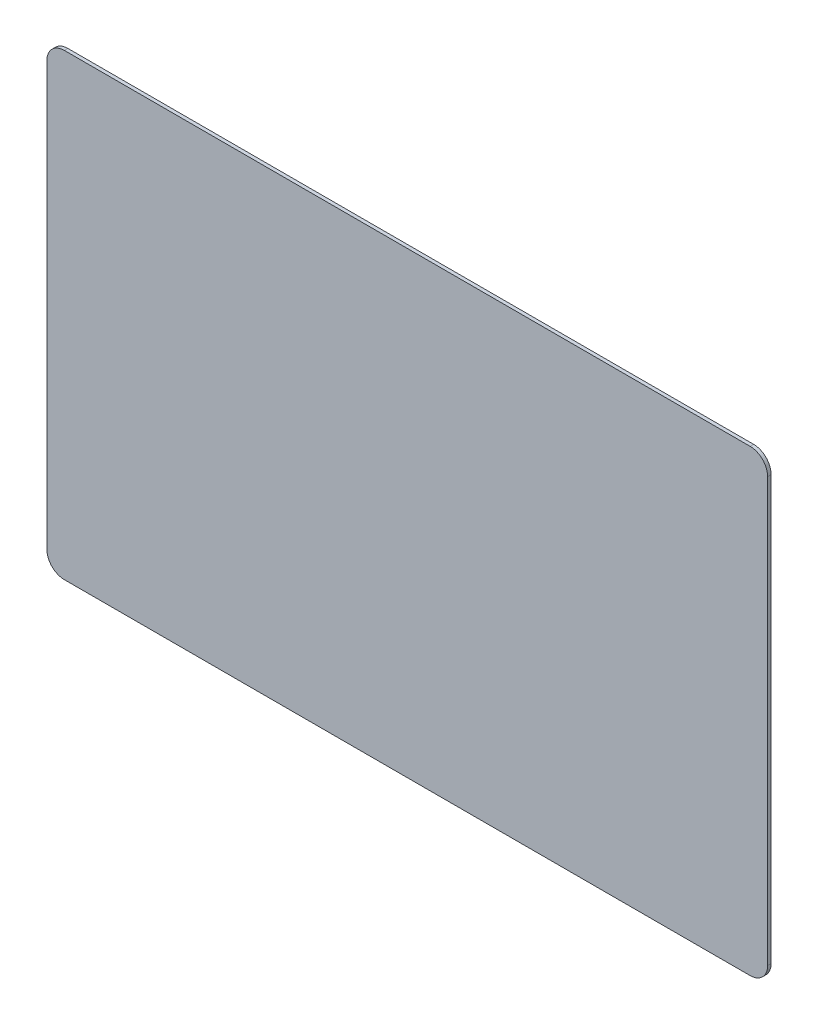
ISO-10303-21;
HEADER;
FILE_DESCRIPTION(('STEP AP214'),'2;1');
FILE_NAME('part.step','',(''),(''),'','','');
FILE_SCHEMA(('AUTOMOTIVE_DESIGN { 1 0 10303 214 1 1 1 1 }'));
ENDSEC;
DATA;
#1=APPLICATION_CONTEXT('core data for automotive mechanical design processes');
#2=APPLICATION_PROTOCOL_DEFINITION('international standard','automotive_design',2000,#1);
#3=PRODUCT_CONTEXT('',#1,'mechanical');
#4=PRODUCT('Part','Part','',(#3));
#5=PRODUCT_RELATED_PRODUCT_CATEGORY('part','',(#4));
#6=PRODUCT_DEFINITION_FORMATION('','',#4);
#7=PRODUCT_DEFINITION_CONTEXT('part definition',#1,'design');
#8=PRODUCT_DEFINITION('design','',#6,#7);
#9=PRODUCT_DEFINITION_SHAPE('','',#8);
#10=(LENGTH_UNIT() NAMED_UNIT(*) SI_UNIT(.MILLI.,.METRE.));
#11=(NAMED_UNIT(*) PLANE_ANGLE_UNIT() SI_UNIT($,.RADIAN.));
#12=(NAMED_UNIT(*) SI_UNIT($,.STERADIAN.) SOLID_ANGLE_UNIT());
#13=UNCERTAINTY_MEASURE_WITH_UNIT(LENGTH_MEASURE(1.E-05),#10,'distance_accuracy_value','');
#14=(GEOMETRIC_REPRESENTATION_CONTEXT(3) GLOBAL_UNCERTAINTY_ASSIGNED_CONTEXT((#13)) GLOBAL_UNIT_ASSIGNED_CONTEXT((#10,
#11,#12)) REPRESENTATION_CONTEXT('',''));
#15=CARTESIAN_POINT('',(0.,0.,0.));
#16=DIRECTION('',(0.,0.,1.));
#17=DIRECTION('',(1.,0.,0.));
#18=AXIS2_PLACEMENT_3D('',#15,#16,#17);
#19=CARTESIAN_POINT('',(-124.502923218294,-124.541494532199,2.));
#20=DIRECTION('',(0.,0.,-1.));
#21=DIRECTION('',(-1.,0.,0.));
#22=AXIS2_PLACEMENT_3D('',#19,#20,#21);
#23=CYLINDRICAL_SURFACE('',#22,9.99999999999999);
#24=CARTESIAN_POINT('',(-124.502923218294,-124.541494532199,0.));
#25=DIRECTION('',(0.,0.,-1.));
#26=DIRECTION('',(-1.,0.,0.));
#27=AXIS2_PLACEMENT_3D('',#24,#25,#26);
#28=CIRCLE('',#27,9.99999999999999);
#29=CARTESIAN_POINT('',(-124.502923218294,-134.541494532199,0.));
#30=VERTEX_POINT('',#29);
#31=CARTESIAN_POINT('',(-134.502923218294,-124.541494532199,0.));
#32=VERTEX_POINT('',#31);
#33=EDGE_CURVE('E138',#30,#32,#28,.T.);
#34=ORIENTED_EDGE('',*,*,#33,.F.);
#35=DIRECTION('',(0.,0.,-1.));
#36=VECTOR('',#35,1.);
#37=CARTESIAN_POINT('',(-124.502923218294,-134.541494532199,2.));
#38=LINE('',#37,#36);
#39=CARTESIAN_POINT('',(-124.502923218294,-134.541494532199,2.));
#40=VERTEX_POINT('',#39);
#41=EDGE_CURVE('E11',#40,#30,#38,.T.);
#42=ORIENTED_EDGE('',*,*,#41,.F.);
#43=CARTESIAN_POINT('',(-124.502923218294,-124.541494532199,2.));
#44=DIRECTION('',(0.,0.,-1.));
#45=DIRECTION('',(-1.,0.,0.));
#46=AXIS2_PLACEMENT_3D('',#43,#44,#45);
#47=CIRCLE('',#46,9.99999999999999);
#48=CARTESIAN_POINT('',(-134.502923218294,-124.541494532199,2.));
#49=VERTEX_POINT('',#48);
#50=EDGE_CURVE('E156',#40,#49,#47,.T.);
#51=ORIENTED_EDGE('',*,*,#50,.T.);
#52=DIRECTION('',(0.,0.,-1.));
#53=VECTOR('',#52,1.);
#54=CARTESIAN_POINT('',(-134.502923218294,-124.541494532199,2.));
#55=LINE('',#54,#53);
#56=EDGE_CURVE('E43',#49,#32,#55,.T.);
#57=ORIENTED_EDGE('',*,*,#56,.T.);
#58=EDGE_LOOP('',(#34,#42,#51,#57));
#59=FACE_BOUND('',#58,.T.);
#60=ADVANCED_FACE('F40',(#59),#23,.T.);
#61=CARTESIAN_POINT('',(-124.502923218294,-134.541494532199,2.));
#62=DIRECTION('',(0.,1.,0.));
#63=DIRECTION('',(0.,0.,1.));
#64=AXIS2_PLACEMENT_3D('',#61,#62,#63);
#65=PLANE('',#64);
#66=DIRECTION('',(1.,0.,0.));
#67=VECTOR('',#66,1.);
#68=CARTESIAN_POINT('',(-124.502923218294,-134.541494532199,0.));
#69=LINE('',#68,#67);
#70=CARTESIAN_POINT('',(267.497076781706,-134.541494532199,0.));
#71=VERTEX_POINT('',#70);
#72=EDGE_CURVE('E85',#30,#71,#69,.T.);
#73=ORIENTED_EDGE('',*,*,#72,.T.);
#74=DIRECTION('',(0.,0.,-1.));
#75=VECTOR('',#74,1.);
#76=CARTESIAN_POINT('',(267.497076781706,-134.541494532199,2.));
#77=LINE('',#76,#75);
#78=CARTESIAN_POINT('',(267.497076781706,-134.541494532199,2.));
#79=VERTEX_POINT('',#78);
#80=EDGE_CURVE('E49',#79,#71,#77,.T.);
#81=ORIENTED_EDGE('',*,*,#80,.F.);
#82=DIRECTION('',(1.,0.,0.));
#83=VECTOR('',#82,1.);
#84=CARTESIAN_POINT('',(-124.502923218294,-134.541494532199,2.));
#85=LINE('',#84,#83);
#86=EDGE_CURVE('E116',#40,#79,#85,.T.);
#87=ORIENTED_EDGE('',*,*,#86,.F.);
#88=ORIENTED_EDGE('',*,*,#41,.T.);
#89=EDGE_LOOP('',(#73,#81,#87,#88));
#90=FACE_BOUND('',#89,.T.);
#91=ADVANCED_FACE('F195',(#90),#65,.F.);
#92=CARTESIAN_POINT('',(267.497076781706,-124.541494532199,2.));
#93=DIRECTION('',(0.,0.,-1.));
#94=DIRECTION('',(-1.,0.,0.));
#95=AXIS2_PLACEMENT_3D('',#92,#93,#94);
#96=CYLINDRICAL_SURFACE('',#95,10.);
#97=CARTESIAN_POINT('',(267.497076781706,-124.541494532199,0.));
#98=DIRECTION('',(0.,0.,1.));
#99=DIRECTION('',(1.,0.,0.));
#100=AXIS2_PLACEMENT_3D('',#97,#98,#99);
#101=CIRCLE('',#100,10.);
#102=CARTESIAN_POINT('',(277.497076781706,-124.541494532199,0.));
#103=VERTEX_POINT('',#102);
#104=EDGE_CURVE('E123',#71,#103,#101,.T.);
#105=ORIENTED_EDGE('',*,*,#104,.T.);
#106=DIRECTION('',(0.,0.,-1.));
#107=VECTOR('',#106,1.);
#108=CARTESIAN_POINT('',(277.497076781706,-124.541494532199,2.));
#109=LINE('',#108,#107);
#110=CARTESIAN_POINT('',(277.497076781706,-124.541494532199,2.));
#111=VERTEX_POINT('',#110);
#112=EDGE_CURVE('E120',#111,#103,#109,.T.);
#113=ORIENTED_EDGE('',*,*,#112,.F.);
#114=CARTESIAN_POINT('',(267.497076781706,-124.541494532199,2.));
#115=DIRECTION('',(0.,0.,1.));
#116=DIRECTION('',(1.,0.,0.));
#117=AXIS2_PLACEMENT_3D('',#114,#115,#116);
#118=CIRCLE('',#117,10.);
#119=EDGE_CURVE('E111',#79,#111,#118,.T.);
#120=ORIENTED_EDGE('',*,*,#119,.F.);
#121=ORIENTED_EDGE('',*,*,#80,.T.);
#122=EDGE_LOOP('',(#105,#113,#120,#121));
#123=FACE_BOUND('',#122,.T.);
#124=ADVANCED_FACE('F121',(#123),#96,.T.);
#125=CARTESIAN_POINT('',(277.497076781706,117.458505467801,2.));
#126=DIRECTION('',(1.,0.,0.));
#127=DIRECTION('',(0.,0.,-1.));
#128=AXIS2_PLACEMENT_3D('',#125,#126,#127);
#129=PLANE('',#128);
#130=DIRECTION('',(0.,-1.,0.));
#131=VECTOR('',#130,1.);
#132=CARTESIAN_POINT('',(277.497076781706,117.458505467801,0.));
#133=LINE('',#132,#131);
#134=CARTESIAN_POINT('',(277.497076781706,117.458505467801,0.));
#135=VERTEX_POINT('',#134);
#136=EDGE_CURVE('E153',#135,#103,#133,.T.);
#137=ORIENTED_EDGE('',*,*,#136,.F.);
#138=DIRECTION('',(0.,0.,-1.));
#139=VECTOR('',#138,1.);
#140=CARTESIAN_POINT('',(277.497076781706,117.458505467801,2.));
#141=LINE('',#140,#139);
#142=CARTESIAN_POINT('',(277.497076781706,117.458505467801,2.));
#143=VERTEX_POINT('',#142);
#144=EDGE_CURVE('E127',#143,#135,#141,.T.);
#145=ORIENTED_EDGE('',*,*,#144,.F.);
#146=DIRECTION('',(0.,-1.,0.));
#147=VECTOR('',#146,1.);
#148=CARTESIAN_POINT('',(277.497076781706,117.458505467801,2.));
#149=LINE('',#148,#147);
#150=EDGE_CURVE('E115',#143,#111,#149,.T.);
#151=ORIENTED_EDGE('',*,*,#150,.T.);
#152=ORIENTED_EDGE('',*,*,#112,.T.);
#153=EDGE_LOOP('',(#137,#145,#151,#152));
#154=FACE_BOUND('',#153,.T.);
#155=ADVANCED_FACE('F129',(#154),#129,.T.);
#156=CARTESIAN_POINT('',(267.497076781706,117.458505467801,2.));
#157=DIRECTION('',(0.,0.,-1.));
#158=DIRECTION('',(-1.,0.,0.));
#159=AXIS2_PLACEMENT_3D('',#156,#157,#158);
#160=CYLINDRICAL_SURFACE('',#159,10.);
#161=CARTESIAN_POINT('',(267.497076781706,117.458505467801,0.));
#162=DIRECTION('',(0.,0.,1.));
#163=DIRECTION('',(1.,0.,0.));
#164=AXIS2_PLACEMENT_3D('',#161,#162,#163);
#165=CIRCLE('',#164,10.);
#166=CARTESIAN_POINT('',(267.497076781706,127.458505467801,0.));
#167=VERTEX_POINT('',#166);
#168=EDGE_CURVE('E150',#135,#167,#165,.T.);
#169=ORIENTED_EDGE('',*,*,#168,.T.);
#170=DIRECTION('',(0.,0.,-1.));
#171=VECTOR('',#170,1.);
#172=CARTESIAN_POINT('',(267.497076781706,127.458505467801,2.));
#173=LINE('',#172,#171);
#174=CARTESIAN_POINT('',(267.497076781706,127.458505467801,2.));
#175=VERTEX_POINT('',#174);
#176=EDGE_CURVE('E160',#175,#167,#173,.T.);
#177=ORIENTED_EDGE('',*,*,#176,.F.);
#178=CARTESIAN_POINT('',(267.497076781706,117.458505467801,2.));
#179=DIRECTION('',(0.,0.,1.));
#180=DIRECTION('',(1.,0.,0.));
#181=AXIS2_PLACEMENT_3D('',#178,#179,#180);
#182=CIRCLE('',#181,10.);
#183=EDGE_CURVE('E131',#143,#175,#182,.T.);
#184=ORIENTED_EDGE('',*,*,#183,.F.);
#185=ORIENTED_EDGE('',*,*,#144,.T.);
#186=EDGE_LOOP('',(#169,#177,#184,#185));
#187=FACE_BOUND('',#186,.T.);
#188=ADVANCED_FACE('F174',(#187),#160,.T.);
#189=CARTESIAN_POINT('',(-124.502923218294,127.458505467801,2.));
#190=DIRECTION('',(0.,1.,0.));
#191=DIRECTION('',(0.,0.,1.));
#192=AXIS2_PLACEMENT_3D('',#189,#190,#191);
#193=PLANE('',#192);
#194=DIRECTION('',(1.,0.,0.));
#195=VECTOR('',#194,1.);
#196=CARTESIAN_POINT('',(-124.502923218294,127.458505467801,0.));
#197=LINE('',#196,#195);
#198=CARTESIAN_POINT('',(-124.502923218294,127.458505467801,0.));
#199=VERTEX_POINT('',#198);
#200=EDGE_CURVE('E147',#199,#167,#197,.T.);
#201=ORIENTED_EDGE('',*,*,#200,.F.);
#202=DIRECTION('',(0.,0.,-1.));
#203=VECTOR('',#202,1.);
#204=CARTESIAN_POINT('',(-124.502923218294,127.458505467801,2.));
#205=LINE('',#204,#203);
#206=CARTESIAN_POINT('',(-124.502923218294,127.458505467801,2.));
#207=VERTEX_POINT('',#206);
#208=EDGE_CURVE('E162',#207,#199,#205,.T.);
#209=ORIENTED_EDGE('',*,*,#208,.F.);
#210=DIRECTION('',(1.,0.,0.));
#211=VECTOR('',#210,1.);
#212=CARTESIAN_POINT('',(-124.502923218294,127.458505467801,2.));
#213=LINE('',#212,#211);
#214=EDGE_CURVE('E133',#207,#175,#213,.T.);
#215=ORIENTED_EDGE('',*,*,#214,.T.);
#216=ORIENTED_EDGE('',*,*,#176,.T.);
#217=EDGE_LOOP('',(#201,#209,#215,#216));
#218=FACE_BOUND('',#217,.T.);
#219=ADVANCED_FACE('F185',(#218),#193,.T.);
#220=CARTESIAN_POINT('',(-124.502923218294,117.458505467801,2.));
#221=DIRECTION('',(0.,0.,-1.));
#222=DIRECTION('',(-1.,0.,0.));
#223=AXIS2_PLACEMENT_3D('',#220,#221,#222);
#224=CYLINDRICAL_SURFACE('',#223,9.99999999999999);
#225=CARTESIAN_POINT('',(-124.502923218294,117.458505467801,0.));
#226=DIRECTION('',(0.,0.,-1.));
#227=DIRECTION('',(-1.,0.,0.));
#228=AXIS2_PLACEMENT_3D('',#225,#226,#227);
#229=CIRCLE('',#228,9.99999999999999);
#230=CARTESIAN_POINT('',(-134.502923218294,117.458505467801,0.));
#231=VERTEX_POINT('',#230);
#232=EDGE_CURVE('E144',#231,#199,#229,.T.);
#233=ORIENTED_EDGE('',*,*,#232,.F.);
#234=DIRECTION('',(0.,0.,-1.));
#235=VECTOR('',#234,1.);
#236=CARTESIAN_POINT('',(-134.502923218294,117.458505467801,2.));
#237=LINE('',#236,#235);
#238=CARTESIAN_POINT('',(-134.502923218294,117.458505467801,2.));
#239=VERTEX_POINT('',#238);
#240=EDGE_CURVE('E163',#239,#231,#237,.T.);
#241=ORIENTED_EDGE('',*,*,#240,.F.);
#242=CARTESIAN_POINT('',(-124.502923218294,117.458505467801,2.));
#243=DIRECTION('',(0.,0.,-1.));
#244=DIRECTION('',(-1.,0.,0.));
#245=AXIS2_PLACEMENT_3D('',#242,#243,#244);
#246=CIRCLE('',#245,9.99999999999999);
#247=EDGE_CURVE('E178',#239,#207,#246,.T.);
#248=ORIENTED_EDGE('',*,*,#247,.T.);
#249=ORIENTED_EDGE('',*,*,#208,.T.);
#250=EDGE_LOOP('',(#233,#241,#248,#249));
#251=FACE_BOUND('',#250,.T.);
#252=ADVANCED_FACE('F181',(#251),#224,.T.);
#253=CARTESIAN_POINT('',(-134.502923218294,117.458505467801,2.));
#254=DIRECTION('',(1.,0.,0.));
#255=DIRECTION('',(0.,0.,-1.));
#256=AXIS2_PLACEMENT_3D('',#253,#254,#255);
#257=PLANE('',#256);
#258=DIRECTION('',(0.,-1.,0.));
#259=VECTOR('',#258,1.);
#260=CARTESIAN_POINT('',(-134.502923218294,117.458505467801,0.));
#261=LINE('',#260,#259);
#262=EDGE_CURVE('E141',#231,#32,#261,.T.);
#263=ORIENTED_EDGE('',*,*,#262,.T.);
#264=ORIENTED_EDGE('',*,*,#56,.F.);
#265=DIRECTION('',(0.,-1.,0.));
#266=VECTOR('',#265,1.);
#267=CARTESIAN_POINT('',(-134.502923218294,117.458505467801,2.));
#268=LINE('',#267,#266);
#269=EDGE_CURVE('E95',#239,#49,#268,.T.);
#270=ORIENTED_EDGE('',*,*,#269,.F.);
#271=ORIENTED_EDGE('',*,*,#240,.T.);
#272=EDGE_LOOP('',(#263,#264,#270,#271));
#273=FACE_BOUND('',#272,.T.);
#274=ADVANCED_FACE('F166',(#273),#257,.F.);
#275=CARTESIAN_POINT('',(-124.502923218294,-124.541494532199,2.));
#276=DIRECTION('',(0.,0.,-1.));
#277=DIRECTION('',(-1.,0.,0.));
#278=AXIS2_PLACEMENT_3D('',#275,#276,#277);
#279=PLANE('',#278);
#280=ORIENTED_EDGE('',*,*,#50,.F.);
#281=ORIENTED_EDGE('',*,*,#86,.T.);
#282=ORIENTED_EDGE('',*,*,#119,.T.);
#283=ORIENTED_EDGE('',*,*,#150,.F.);
#284=ORIENTED_EDGE('',*,*,#183,.T.);
#285=ORIENTED_EDGE('',*,*,#214,.F.);
#286=ORIENTED_EDGE('',*,*,#247,.F.);
#287=ORIENTED_EDGE('',*,*,#269,.T.);
#288=EDGE_LOOP('',(#280,#281,#282,#283,#284,#285,#286,#287));
#289=FACE_BOUND('',#288,.T.);
#290=ADVANCED_FACE('F113',(#289),#279,.F.);
#291=CARTESIAN_POINT('',(-124.502923218294,-124.541494532199,0.));
#292=DIRECTION('',(0.,0.,-1.));
#293=DIRECTION('',(-1.,0.,0.));
#294=AXIS2_PLACEMENT_3D('',#291,#292,#293);
#295=PLANE('',#294);
#296=ORIENTED_EDGE('',*,*,#33,.T.);
#297=ORIENTED_EDGE('',*,*,#262,.F.);
#298=ORIENTED_EDGE('',*,*,#232,.T.);
#299=ORIENTED_EDGE('',*,*,#200,.T.);
#300=ORIENTED_EDGE('',*,*,#168,.F.);
#301=ORIENTED_EDGE('',*,*,#136,.T.);
#302=ORIENTED_EDGE('',*,*,#104,.F.);
#303=ORIENTED_EDGE('',*,*,#72,.F.);
#304=EDGE_LOOP('',(#296,#297,#298,#299,#300,#301,#302,#303));
#305=FACE_BOUND('',#304,.T.);
#306=ADVANCED_FACE('F169',(#305),#295,.T.);
#307=CLOSED_SHELL('',(#60,#91,#124,#155,#188,#219,#252,#274,#290,#306));
#308=MANIFOLD_SOLID_BREP('B2',#307);
#309=ADVANCED_BREP_SHAPE_REPRESENTATION('',(#18,#308),#14);
#310=SHAPE_DEFINITION_REPRESENTATION(#9,#309);
ENDSEC;
END-ISO-10303-21;
